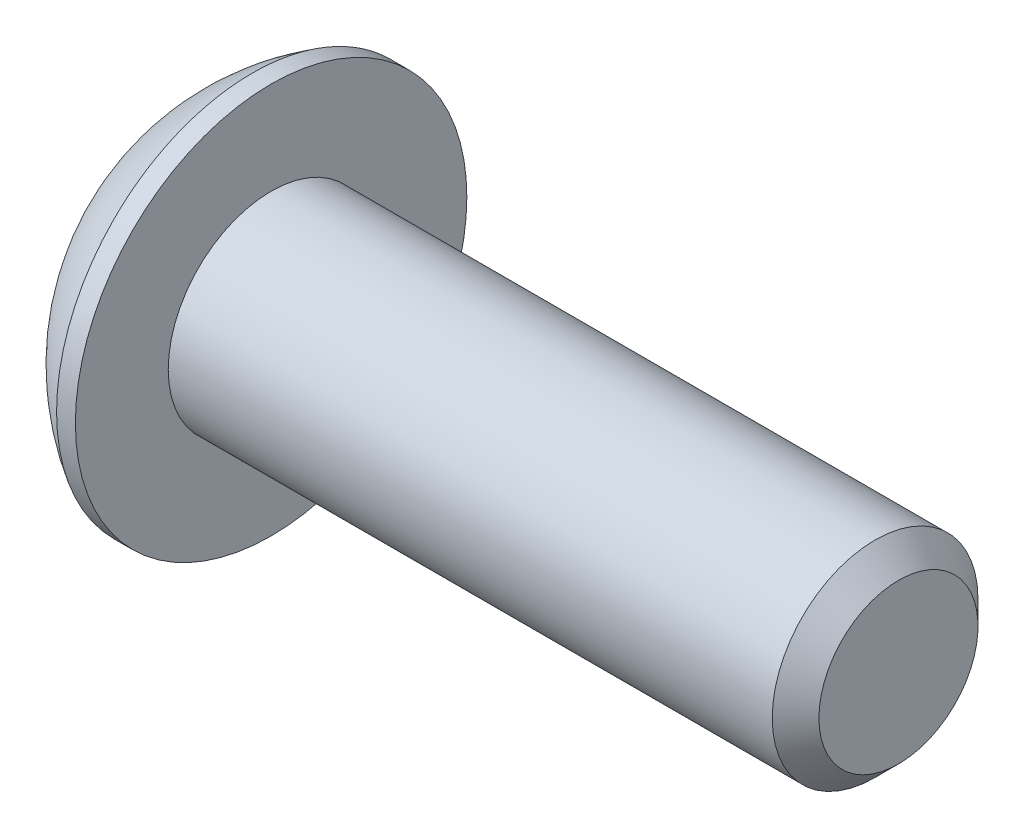
ISO-10303-21;
HEADER;
FILE_DESCRIPTION(('STEP AP214'),'2;1');
FILE_NAME('part.step','',(''),(''),'','','');
FILE_SCHEMA(('AUTOMOTIVE_DESIGN { 1 0 10303 214 1 1 1 1 }'));
ENDSEC;
DATA;
#1=APPLICATION_CONTEXT('core data for automotive mechanical design processes');
#2=APPLICATION_PROTOCOL_DEFINITION('international standard','automotive_design',2000,#1);
#3=PRODUCT_CONTEXT('',#1,'mechanical');
#4=PRODUCT('Part','Part','',(#3));
#5=PRODUCT_RELATED_PRODUCT_CATEGORY('part','',(#4));
#6=PRODUCT_DEFINITION_FORMATION('','',#4);
#7=PRODUCT_DEFINITION_CONTEXT('part definition',#1,'design');
#8=PRODUCT_DEFINITION('design','',#6,#7);
#9=PRODUCT_DEFINITION_SHAPE('','',#8);
#10=(LENGTH_UNIT() NAMED_UNIT(*) SI_UNIT(.MILLI.,.METRE.));
#11=(NAMED_UNIT(*) PLANE_ANGLE_UNIT() SI_UNIT($,.RADIAN.));
#12=(NAMED_UNIT(*) SI_UNIT($,.STERADIAN.) SOLID_ANGLE_UNIT());
#13=UNCERTAINTY_MEASURE_WITH_UNIT(LENGTH_MEASURE(1.E-05),#10,'distance_accuracy_value','');
#14=(GEOMETRIC_REPRESENTATION_CONTEXT(3) GLOBAL_UNCERTAINTY_ASSIGNED_CONTEXT((#13)) GLOBAL_UNIT_ASSIGNED_CONTEXT((#10,
#11,#12)) REPRESENTATION_CONTEXT('',''));
#15=CARTESIAN_POINT('',(0.,0.,0.));
#16=DIRECTION('',(0.,0.,1.));
#17=DIRECTION('',(1.,0.,0.));
#18=AXIS2_PLACEMENT_3D('',#15,#16,#17);
#19=CARTESIAN_POINT('',(1.32080000000034,0.,0.));
#20=DIRECTION('',(-1.,0.,0.));
#21=DIRECTION('',(0.,0.,1.));
#22=AXIS2_PLACEMENT_3D('',#19,#20,#21);
#23=CONICAL_SURFACE('',#22,1.1937999999998,1.04719755119608);
#24=CARTESIAN_POINT('',(2.01004075135902,0.,4.44089209850063E-13));
#25=VERTEX_POINT('',#24);
#26=VERTEX_LOOP('',#25);
#27=FACE_BOUND('',#26,.T.);
#28=CARTESIAN_POINT('',(1.32080000000009,0.,0.));
#29=DIRECTION('',(-1.,0.,0.));
#30=DIRECTION('',(0.,0.,1.));
#31=AXIS2_PLACEMENT_3D('',#28,#29,#30);
#32=CIRCLE('',#31,1.19380000000024);
#33=CARTESIAN_POINT('',(1.32080000000004,-1.03386112703797,0.59690000000006));
#34=VERTEX_POINT('',#33);
#35=CARTESIAN_POINT('',(1.32080000000004,0.,1.19380000000012));
#36=VERTEX_POINT('',#35);
#37=EDGE_CURVE('E19',#34,#36,#32,.T.);
#38=ORIENTED_EDGE('',*,*,#37,.T.);
#39=CARTESIAN_POINT('',(1.32080000000009,0.,0.));
#40=DIRECTION('',(-1.,0.,0.));
#41=DIRECTION('',(0.,0.,1.));
#42=AXIS2_PLACEMENT_3D('',#39,#40,#41);
#43=CIRCLE('',#42,1.19380000000024);
#44=CARTESIAN_POINT('',(1.32080000000004,1.03386112703797,0.596900000000061));
#45=VERTEX_POINT('',#44);
#46=EDGE_CURVE('E147',#36,#45,#43,.T.);
#47=ORIENTED_EDGE('',*,*,#46,.T.);
#48=CARTESIAN_POINT('',(1.32080000000009,0.,0.));
#49=DIRECTION('',(-1.,0.,0.));
#50=DIRECTION('',(0.,0.,1.));
#51=AXIS2_PLACEMENT_3D('',#48,#49,#50);
#52=CIRCLE('',#51,1.19380000000024);
#53=CARTESIAN_POINT('',(1.32080000000004,1.03386112703797,-0.596900000000061));
#54=VERTEX_POINT('',#53);
#55=EDGE_CURVE('E402',#45,#54,#52,.T.);
#56=ORIENTED_EDGE('',*,*,#55,.T.);
#57=CARTESIAN_POINT('',(1.32080000000009,0.,0.));
#58=DIRECTION('',(-1.,0.,0.));
#59=DIRECTION('',(0.,0.,1.));
#60=AXIS2_PLACEMENT_3D('',#57,#58,#59);
#61=CIRCLE('',#60,1.19380000000024);
#62=CARTESIAN_POINT('',(1.32080000000004,1.49457637585666E-12,-1.19380000000012));
#63=VERTEX_POINT('',#62);
#64=EDGE_CURVE('E403',#54,#63,#61,.T.);
#65=ORIENTED_EDGE('',*,*,#64,.T.);
#66=CARTESIAN_POINT('',(1.32080000000009,0.,0.));
#67=DIRECTION('',(-1.,0.,0.));
#68=DIRECTION('',(0.,0.,1.));
#69=AXIS2_PLACEMENT_3D('',#66,#67,#68);
#70=CIRCLE('',#69,1.19380000000024);
#71=CARTESIAN_POINT('',(1.32080000000004,-1.03386112703797,-0.59690000000006));
#72=VERTEX_POINT('',#71);
#73=EDGE_CURVE('E92',#63,#72,#70,.T.);
#74=ORIENTED_EDGE('',*,*,#73,.T.);
#75=CARTESIAN_POINT('',(1.32080000000009,0.,0.));
#76=DIRECTION('',(-1.,0.,0.));
#77=DIRECTION('',(0.,0.,1.));
#78=AXIS2_PLACEMENT_3D('',#75,#76,#77);
#79=CIRCLE('',#78,1.19380000000024);
#80=EDGE_CURVE('E88',#72,#34,#79,.T.);
#81=ORIENTED_EDGE('',*,*,#80,.T.);
#82=EDGE_LOOP('',(#38,#47,#56,#65,#74,#81));
#83=FACE_BOUND('',#82,.T.);
#84=ADVANCED_FACE('F16',(#27,#83),#23,.F.);
#85=CARTESIAN_POINT('',(1.3208,-2.06772225407572,-1.1938));
#86=DIRECTION('',(1.,0.,0.));
#87=DIRECTION('',(0.,0.,-1.));
#88=AXIS2_PLACEMENT_3D('',#85,#86,#87);
#89=PLANE('',#88);
#90=DIRECTION('',(0.,0.5,0.866025403784439));
#91=VECTOR('',#90,1.);
#92=CARTESIAN_POINT('',(1.3208,-1.37848150271715,0.));
#93=LINE('',#92,#91);
#94=CARTESIAN_POINT('',(1.3208,-0.689240751358574,1.1938));
#95=VERTEX_POINT('',#94);
#96=EDGE_CURVE('E100',#95,#34,#93,.F.);
#97=ORIENTED_EDGE('',*,*,#96,.F.);
#98=DIRECTION('',(0.,1.,0.));
#99=VECTOR('',#98,1.);
#100=CARTESIAN_POINT('',(1.3208,-0.689240751358574,1.1938));
#101=LINE('',#100,#99);
#102=EDGE_CURVE('E102',#36,#95,#101,.F.);
#103=ORIENTED_EDGE('',*,*,#102,.F.);
#104=ORIENTED_EDGE('',*,*,#37,.F.);
#105=EDGE_LOOP('',(#97,#103,#104));
#106=FACE_BOUND('',#105,.T.);
#107=ADVANCED_FACE('F98',(#106),#89,.F.);
#108=CARTESIAN_POINT('',(1.3208,-2.06772225407572,-1.1938));
#109=DIRECTION('',(1.,0.,0.));
#110=DIRECTION('',(0.,0.,-1.));
#111=AXIS2_PLACEMENT_3D('',#108,#109,#110);
#112=PLANE('',#111);
#113=DIRECTION('',(0.,-0.5,0.866025403784439));
#114=VECTOR('',#113,1.);
#115=CARTESIAN_POINT('',(1.3208,-0.689240751358574,-1.1938));
#116=LINE('',#115,#114);
#117=CARTESIAN_POINT('',(1.3208,-1.37848150271715,0.));
#118=VERTEX_POINT('',#117);
#119=EDGE_CURVE('E108',#118,#72,#116,.F.);
#120=ORIENTED_EDGE('',*,*,#119,.F.);
#121=DIRECTION('',(0.,0.5,0.866025403784439));
#122=VECTOR('',#121,1.);
#123=CARTESIAN_POINT('',(1.3208,-1.37848150271715,0.));
#124=LINE('',#123,#122);
#125=EDGE_CURVE('E105',#34,#118,#124,.F.);
#126=ORIENTED_EDGE('',*,*,#125,.F.);
#127=ORIENTED_EDGE('',*,*,#80,.F.);
#128=EDGE_LOOP('',(#120,#126,#127));
#129=FACE_BOUND('',#128,.T.);
#130=ADVANCED_FACE('F106',(#129),#112,.F.);
#131=CARTESIAN_POINT('',(1.3208,-2.06772225407572,-1.1938));
#132=DIRECTION('',(1.,0.,0.));
#133=DIRECTION('',(0.,0.,-1.));
#134=AXIS2_PLACEMENT_3D('',#131,#132,#133);
#135=PLANE('',#134);
#136=DIRECTION('',(0.,1.,0.));
#137=VECTOR('',#136,1.);
#138=CARTESIAN_POINT('',(1.3208,0.689240751358577,-1.1938));
#139=LINE('',#138,#137);
#140=CARTESIAN_POINT('',(1.3208,-0.689240751358574,-1.1938));
#141=VERTEX_POINT('',#140);
#142=EDGE_CURVE('E373',#141,#63,#139,.T.);
#143=ORIENTED_EDGE('',*,*,#142,.F.);
#144=DIRECTION('',(0.,-0.5,0.866025403784439));
#145=VECTOR('',#144,1.);
#146=CARTESIAN_POINT('',(1.3208,-0.689240751358574,-1.1938));
#147=LINE('',#146,#145);
#148=EDGE_CURVE('E385',#72,#141,#147,.F.);
#149=ORIENTED_EDGE('',*,*,#148,.F.);
#150=ORIENTED_EDGE('',*,*,#73,.F.);
#151=EDGE_LOOP('',(#143,#149,#150));
#152=FACE_BOUND('',#151,.T.);
#153=ADVANCED_FACE('F190',(#152),#135,.F.);
#154=CARTESIAN_POINT('',(1.3208,-2.06772225407572,-1.1938));
#155=DIRECTION('',(1.,0.,0.));
#156=DIRECTION('',(0.,0.,-1.));
#157=AXIS2_PLACEMENT_3D('',#154,#155,#156);
#158=PLANE('',#157);
#159=DIRECTION('',(0.,-0.5,-0.866025403784439));
#160=VECTOR('',#159,1.);
#161=CARTESIAN_POINT('',(1.3208,1.37848150271715,0.));
#162=LINE('',#161,#160);
#163=CARTESIAN_POINT('',(1.3208,0.689240751358577,-1.1938));
#164=VERTEX_POINT('',#163);
#165=EDGE_CURVE('E359',#164,#54,#162,.F.);
#166=ORIENTED_EDGE('',*,*,#165,.F.);
#167=DIRECTION('',(0.,1.,0.));
#168=VECTOR('',#167,1.);
#169=CARTESIAN_POINT('',(1.3208,0.689240751358577,-1.1938));
#170=LINE('',#169,#168);
#171=EDGE_CURVE('E370',#63,#164,#170,.T.);
#172=ORIENTED_EDGE('',*,*,#171,.F.);
#173=ORIENTED_EDGE('',*,*,#64,.F.);
#174=EDGE_LOOP('',(#166,#172,#173));
#175=FACE_BOUND('',#174,.T.);
#176=ADVANCED_FACE('F186',(#175),#158,.F.);
#177=CARTESIAN_POINT('',(1.3208,-2.06772225407572,-1.1938));
#178=DIRECTION('',(1.,0.,0.));
#179=DIRECTION('',(0.,0.,-1.));
#180=AXIS2_PLACEMENT_3D('',#177,#178,#179);
#181=PLANE('',#180);
#182=DIRECTION('',(0.,0.5,-0.866025403784439));
#183=VECTOR('',#182,1.);
#184=CARTESIAN_POINT('',(1.3208,0.689240751358576,1.1938));
#185=LINE('',#184,#183);
#186=CARTESIAN_POINT('',(1.3208,1.37848150271715,0.));
#187=VERTEX_POINT('',#186);
#188=EDGE_CURVE('E338',#187,#45,#185,.F.);
#189=ORIENTED_EDGE('',*,*,#188,.F.);
#190=DIRECTION('',(0.,-0.5,-0.866025403784439));
#191=VECTOR('',#190,1.);
#192=CARTESIAN_POINT('',(1.3208,1.37848150271715,0.));
#193=LINE('',#192,#191);
#194=EDGE_CURVE('E357',#54,#187,#193,.F.);
#195=ORIENTED_EDGE('',*,*,#194,.F.);
#196=ORIENTED_EDGE('',*,*,#55,.F.);
#197=EDGE_LOOP('',(#189,#195,#196));
#198=FACE_BOUND('',#197,.T.);
#199=ADVANCED_FACE('F182',(#198),#181,.F.);
#200=CARTESIAN_POINT('',(1.3208,-2.06772225407572,-1.1938));
#201=DIRECTION('',(1.,0.,0.));
#202=DIRECTION('',(0.,0.,-1.));
#203=AXIS2_PLACEMENT_3D('',#200,#201,#202);
#204=PLANE('',#203);
#205=DIRECTION('',(0.,1.,0.));
#206=VECTOR('',#205,1.);
#207=CARTESIAN_POINT('',(1.3208,-0.689240751358574,1.1938));
#208=LINE('',#207,#206);
#209=CARTESIAN_POINT('',(1.3208,0.689240751358576,1.1938));
#210=VERTEX_POINT('',#209);
#211=EDGE_CURVE('E117',#210,#36,#208,.F.);
#212=ORIENTED_EDGE('',*,*,#211,.F.);
#213=DIRECTION('',(0.,0.5,-0.866025403784439));
#214=VECTOR('',#213,1.);
#215=CARTESIAN_POINT('',(1.3208,0.689240751358576,1.1938));
#216=LINE('',#215,#214);
#217=EDGE_CURVE('E341',#45,#210,#216,.F.);
#218=ORIENTED_EDGE('',*,*,#217,.F.);
#219=ORIENTED_EDGE('',*,*,#46,.F.);
#220=EDGE_LOOP('',(#212,#218,#219));
#221=FACE_BOUND('',#220,.T.);
#222=ADVANCED_FACE('F178',(#221),#204,.F.);
#223=CARTESIAN_POINT('',(1.3208,-0.689240751358574,1.1938));
#224=DIRECTION('',(0.,0.,-1.));
#225=DIRECTION('',(0.,1.,0.));
#226=AXIS2_PLACEMENT_3D('',#223,#224,#225);
#227=PLANE('',#226);
#228=DIRECTION('',(0.,1.,0.));
#229=VECTOR('',#228,1.);
#230=CARTESIAN_POINT('',(0.,0.,1.1938));
#231=LINE('',#230,#229);
#232=CARTESIAN_POINT('',(0.,0.689240751358577,1.1938));
#233=VERTEX_POINT('',#232);
#234=CARTESIAN_POINT('',(0.,-0.689240751358574,1.1938));
#235=VERTEX_POINT('',#234);
#236=EDGE_CURVE('E335',#233,#235,#231,.F.);
#237=ORIENTED_EDGE('',*,*,#236,.F.);
#238=DIRECTION('',(1.,0.,0.));
#239=VECTOR('',#238,1.);
#240=CARTESIAN_POINT('',(1.3208,0.689240751358576,1.1938));
#241=LINE('',#240,#239);
#242=EDGE_CURVE('E347',#210,#233,#241,.F.);
#243=ORIENTED_EDGE('',*,*,#242,.F.);
#244=ORIENTED_EDGE('',*,*,#211,.T.);
#245=ORIENTED_EDGE('',*,*,#102,.T.);
#246=DIRECTION('',(1.,0.,0.));
#247=VECTOR('',#246,1.);
#248=CARTESIAN_POINT('',(1.3208,-0.689240751358574,1.1938));
#249=LINE('',#248,#247);
#250=EDGE_CURVE('E111',#235,#95,#249,.T.);
#251=ORIENTED_EDGE('',*,*,#250,.F.);
#252=EDGE_LOOP('',(#237,#243,#244,#245,#251));
#253=FACE_BOUND('',#252,.T.);
#254=ADVANCED_FACE('F175',(#253),#227,.T.);
#255=CARTESIAN_POINT('',(1.3208,-1.37848150271715,0.));
#256=DIRECTION('',(0.,0.866025403784439,-0.5));
#257=DIRECTION('',(0.,0.5,0.866025403784439));
#258=AXIS2_PLACEMENT_3D('',#255,#256,#257);
#259=PLANE('',#258);
#260=DIRECTION('',(0.,-0.5,-0.866025403784439));
#261=VECTOR('',#260,1.);
#262=CARTESIAN_POINT('',(0.,-0.689240751358574,1.1938));
#263=LINE('',#262,#261);
#264=CARTESIAN_POINT('',(0.,-1.37848150271715,0.));
#265=VERTEX_POINT('',#264);
#266=EDGE_CURVE('E332',#235,#265,#263,.T.);
#267=ORIENTED_EDGE('',*,*,#266,.F.);
#268=ORIENTED_EDGE('',*,*,#250,.T.);
#269=ORIENTED_EDGE('',*,*,#96,.T.);
#270=ORIENTED_EDGE('',*,*,#125,.T.);
#271=DIRECTION('',(1.,0.,0.));
#272=VECTOR('',#271,1.);
#273=CARTESIAN_POINT('',(1.3208,-1.37848150271715,0.));
#274=LINE('',#273,#272);
#275=EDGE_CURVE('E382',#265,#118,#274,.T.);
#276=ORIENTED_EDGE('',*,*,#275,.F.);
#277=EDGE_LOOP('',(#267,#268,#269,#270,#276));
#278=FACE_BOUND('',#277,.T.);
#279=ADVANCED_FACE('F115',(#278),#259,.T.);
#280=CARTESIAN_POINT('',(1.3208,-0.689240751358574,-1.1938));
#281=DIRECTION('',(0.,0.866025403784439,0.5));
#282=DIRECTION('',(0.,-0.5,0.866025403784439));
#283=AXIS2_PLACEMENT_3D('',#280,#281,#282);
#284=PLANE('',#283);
#285=DIRECTION('',(0.,0.5,-0.866025403784439));
#286=VECTOR('',#285,1.);
#287=CARTESIAN_POINT('',(0.,-1.37848150271715,0.));
#288=LINE('',#287,#286);
#289=CARTESIAN_POINT('',(0.,-0.689240751358574,-1.1938));
#290=VERTEX_POINT('',#289);
#291=EDGE_CURVE('E329',#265,#290,#288,.T.);
#292=ORIENTED_EDGE('',*,*,#291,.F.);
#293=ORIENTED_EDGE('',*,*,#275,.T.);
#294=ORIENTED_EDGE('',*,*,#119,.T.);
#295=ORIENTED_EDGE('',*,*,#148,.T.);
#296=DIRECTION('',(1.,0.,0.));
#297=VECTOR('',#296,1.);
#298=CARTESIAN_POINT('',(1.3208,-0.689240751358574,-1.1938));
#299=LINE('',#298,#297);
#300=EDGE_CURVE('E367',#290,#141,#299,.T.);
#301=ORIENTED_EDGE('',*,*,#300,.F.);
#302=EDGE_LOOP('',(#292,#293,#294,#295,#301));
#303=FACE_BOUND('',#302,.T.);
#304=ADVANCED_FACE('F168',(#303),#284,.T.);
#305=CARTESIAN_POINT('',(1.3208,0.689240751358577,-1.1938));
#306=DIRECTION('',(0.,0.,1.));
#307=DIRECTION('',(1.,0.,0.));
#308=AXIS2_PLACEMENT_3D('',#305,#306,#307);
#309=PLANE('',#308);
#310=DIRECTION('',(0.,1.,0.));
#311=VECTOR('',#310,1.);
#312=CARTESIAN_POINT('',(0.,0.,-1.1938));
#313=LINE('',#312,#311);
#314=CARTESIAN_POINT('',(0.,0.689240751358577,-1.1938));
#315=VERTEX_POINT('',#314);
#316=EDGE_CURVE('E326',#290,#315,#313,.T.);
#317=ORIENTED_EDGE('',*,*,#316,.F.);
#318=ORIENTED_EDGE('',*,*,#300,.T.);
#319=ORIENTED_EDGE('',*,*,#142,.T.);
#320=ORIENTED_EDGE('',*,*,#171,.T.);
#321=DIRECTION('',(1.,0.,0.));
#322=VECTOR('',#321,1.);
#323=CARTESIAN_POINT('',(1.3208,0.689240751358577,-1.1938));
#324=LINE('',#323,#322);
#325=EDGE_CURVE('E342',#315,#164,#324,.T.);
#326=ORIENTED_EDGE('',*,*,#325,.F.);
#327=EDGE_LOOP('',(#317,#318,#319,#320,#326));
#328=FACE_BOUND('',#327,.T.);
#329=ADVANCED_FACE('F165',(#328),#309,.T.);
#330=CARTESIAN_POINT('',(1.3208,1.37848150271715,0.));
#331=DIRECTION('',(0.,-0.866025403784439,0.5));
#332=DIRECTION('',(0.,-0.5,-0.866025403784439));
#333=AXIS2_PLACEMENT_3D('',#330,#331,#332);
#334=PLANE('',#333);
#335=DIRECTION('',(0.,0.5,0.866025403784439));
#336=VECTOR('',#335,1.);
#337=CARTESIAN_POINT('',(0.,0.689240751358577,-1.1938));
#338=LINE('',#337,#336);
#339=CARTESIAN_POINT('',(0.,1.37848150271715,0.));
#340=VERTEX_POINT('',#339);
#341=EDGE_CURVE('E323',#315,#340,#338,.T.);
#342=ORIENTED_EDGE('',*,*,#341,.F.);
#343=ORIENTED_EDGE('',*,*,#325,.T.);
#344=ORIENTED_EDGE('',*,*,#165,.T.);
#345=ORIENTED_EDGE('',*,*,#194,.T.);
#346=DIRECTION('',(1.,0.,0.));
#347=VECTOR('',#346,1.);
#348=CARTESIAN_POINT('',(1.3208,1.37848150271715,0.));
#349=LINE('',#348,#347);
#350=EDGE_CURVE('E34',#340,#187,#349,.T.);
#351=ORIENTED_EDGE('',*,*,#350,.F.);
#352=EDGE_LOOP('',(#342,#343,#344,#345,#351));
#353=FACE_BOUND('',#352,.T.);
#354=ADVANCED_FACE('F161',(#353),#334,.T.);
#355=CARTESIAN_POINT('',(1.3208,0.689240751358576,1.1938));
#356=DIRECTION('',(0.,-0.866025403784439,-0.5));
#357=DIRECTION('',(0.,0.5,-0.866025403784439));
#358=AXIS2_PLACEMENT_3D('',#355,#356,#357);
#359=PLANE('',#358);
#360=DIRECTION('',(0.,-0.5,0.866025403784439));
#361=VECTOR('',#360,1.);
#362=CARTESIAN_POINT('',(0.,1.37848150271715,0.));
#363=LINE('',#362,#361);
#364=EDGE_CURVE('E146',#340,#233,#363,.T.);
#365=ORIENTED_EDGE('',*,*,#364,.F.);
#366=ORIENTED_EDGE('',*,*,#350,.T.);
#367=ORIENTED_EDGE('',*,*,#188,.T.);
#368=ORIENTED_EDGE('',*,*,#217,.T.);
#369=ORIENTED_EDGE('',*,*,#242,.T.);
#370=EDGE_LOOP('',(#365,#366,#367,#368,#369));
#371=FACE_BOUND('',#370,.T.);
#372=ADVANCED_FACE('F157',(#371),#359,.T.);
#373=CARTESIAN_POINT('',(0.,0.,0.));
#374=DIRECTION('',(-1.,0.,0.));
#375=DIRECTION('',(0.,0.,1.));
#376=AXIS2_PLACEMENT_3D('',#373,#374,#375);
#377=PLANE('',#376);
#378=ORIENTED_EDGE('',*,*,#341,.T.);
#379=ORIENTED_EDGE('',*,*,#364,.T.);
#380=ORIENTED_EDGE('',*,*,#236,.T.);
#381=ORIENTED_EDGE('',*,*,#266,.T.);
#382=ORIENTED_EDGE('',*,*,#291,.T.);
#383=ORIENTED_EDGE('',*,*,#316,.T.);
#384=EDGE_LOOP('',(#378,#379,#380,#381,#382,#383));
#385=FACE_BOUND('',#384,.T.);
#386=CARTESIAN_POINT('',(0.,1.9812,0.));
#387=CARTESIAN_POINT('',(0.,1.9811996664299,0.0556258831179428));
#388=CARTESIAN_POINT('',(0.,1.97885520380442,0.111261989398606));
#389=CARTESIAN_POINT('',(0.,1.96949260169541,0.222149719830458));
#390=CARTESIAN_POINT('',(0.,1.96247308239605,0.277401225602895));
#391=CARTESIAN_POINT('',(0.,1.94379192841038,0.387209508139747));
#392=CARTESIAN_POINT('',(-1.85325793235264E-13,1.93212292489526,0.441765039546365));
#393=CARTESIAN_POINT('',(1.86344214223505E-13,1.90422331175315,0.549729449347493));
#394=CARTESIAN_POINT('',(6.94543371897454E-13,1.88798900035338,0.603137359208869));
#395=CARTESIAN_POINT('',(1.15501975216981E-12,1.83266214476501,0.760839131321828));
#396=CARTESIAN_POINT('',(0.,1.78690023648845,0.862876433575429));
#397=CARTESIAN_POINT('',(0.,1.67887358150667,1.05780719540872));
#398=CARTESIAN_POINT('',(9.54193214892627E-13,1.6166082074585,1.15070030720801));
#399=CARTESIAN_POINT('',(5.94805591894675E-13,1.51224157140982,1.28116890915697));
#400=CARTESIAN_POINT('',(1.63221293851378E-13,1.4755970394354,1.32320451127026));
#401=CARTESIAN_POINT('',(-1.62196980336157E-13,1.39893832619713,1.40400288695709));
#402=CARTESIAN_POINT('',(0.,1.35892742784698,1.44276877695455));
#403=CARTESIAN_POINT('',(1.14362537325405E-13,1.23416504602197,1.55382272417904));
#404=CARTESIAN_POINT('',(0.,1.14466125559859,1.62089527952111));
#405=CARTESIAN_POINT('',(0.,0.955712144178167,1.7390221808118));
#406=CARTESIAN_POINT('',(0.,0.856267198233564,1.79007713076007));
#407=CARTESIAN_POINT('',(0.,0.650206345910843,1.87477637530954));
#408=CARTESIAN_POINT('',(0.,0.543590516134855,1.90842085586267));
#409=CARTESIAN_POINT('',(0.,0.326226155292018,1.95733039300656));
#410=CARTESIAN_POINT('',(0.,0.21547760215793,1.97259535144288));
#411=CARTESIAN_POINT('',(0.,-0.00701040587544639,1.98431697865418));
#412=CARTESIAN_POINT('',(0.,-0.118749860774734,1.98077364742917));
#413=CARTESIAN_POINT('',(0.,-0.340050178355485,1.95497485623825));
#414=CARTESIAN_POINT('',(0.,-0.449611052668255,1.93271949620218));
#415=CARTESIAN_POINT('',(0.,-0.663431110729174,1.87014138774523));
#416=CARTESIAN_POINT('',(0.,-0.76769023783852,1.82981844635272));
#417=CARTESIAN_POINT('',(0.,-0.968005760719347,1.73219968377096));
#418=CARTESIAN_POINT('',(0.,-1.0640618469811,1.6749032225164));
#419=CARTESIAN_POINT('',(0.,-1.19980276751283,1.57757371205873));
#420=CARTESIAN_POINT('',(0.,-1.24366557129213,1.54322665019466));
#421=CARTESIAN_POINT('',(0.,-1.32838995706696,1.47093063174264));
#422=CARTESIAN_POINT('',(0.,-1.36924860178706,1.43297823102439));
#423=CARTESIAN_POINT('',(0.,-1.48674671849223,1.31419842051173));
#424=CARTESIAN_POINT('',(0.,-1.55842832343237,1.22836221289311));
#425=CARTESIAN_POINT('',(0.,-1.6863396856475,1.04586168272493));
#426=CARTESIAN_POINT('',(0.,-1.7425700302488,0.949197771949774));
#427=CARTESIAN_POINT('',(0.,-1.8141614250401,0.798182600298684));
#428=CARTESIAN_POINT('',(0.,-1.83591780585875,0.746776203847791));
#429=CARTESIAN_POINT('',(0.,-1.87500754181092,0.642341081688636));
#430=CARTESIAN_POINT('',(0.,-1.89234447645404,0.589313708122847));
#431=CARTESIAN_POINT('',(0.,-1.92246053433554,0.482076273028395));
#432=CARTESIAN_POINT('',(0.,-1.93524685475118,0.42786822425751));
#433=CARTESIAN_POINT('',(0.,-1.95620937250494,0.318578151844611));
#434=CARTESIAN_POINT('',(0.,-1.96438692958147,0.263496390912872));
#435=CARTESIAN_POINT('',(0.,-1.97388528284653,0.173607715038558));
#436=CARTESIAN_POINT('',(0.,-1.97662743364426,0.138944718024998));
#437=CARTESIAN_POINT('',(0.,-1.98028489645283,0.0695224782567002));
#438=CARTESIAN_POINT('',(0.,-1.98120020846367,0.0347632355019631));
#439=CARTESIAN_POINT('',(0.,-1.9811996664299,-0.0556258831179437));
#440=CARTESIAN_POINT('',(0.,-1.97885520380442,-0.111261989398607));
#441=CARTESIAN_POINT('',(0.,-1.96949260169541,-0.222149719830459));
#442=CARTESIAN_POINT('',(0.,-1.96247308239605,-0.277401225602897));
#443=CARTESIAN_POINT('',(0.,-1.94379192841039,-0.387209508139749));
#444=CARTESIAN_POINT('',(-1.85269749640691E-13,-1.93212292489526,-0.441765039546367));
#445=CARTESIAN_POINT('',(1.86288125054388E-13,-1.90422331175315,-0.549729449347495));
#446=CARTESIAN_POINT('',(6.94525090263764E-13,-1.88798900035338,-0.603137359208872));
#447=CARTESIAN_POINT('',(1.15505622829081E-12,-1.83266214476501,-0.760839131321831));
#448=CARTESIAN_POINT('',(0.,-1.78690023648845,-0.862876433575431));
#449=CARTESIAN_POINT('',(0.,-1.67887358150667,-1.05780719540872));
#450=CARTESIAN_POINT('',(9.54248812869379E-13,-1.6166082074585,-1.15070030720801));
#451=CARTESIAN_POINT('',(5.94777756479239E-13,-1.51224157140982,-1.28116890915698));
#452=CARTESIAN_POINT('',(1.63138949183833E-13,-1.47559703943539,-1.32320451127027));
#453=CARTESIAN_POINT('',(-1.62114715061273E-13,-1.39893832619713,-1.40400288695709));
#454=CARTESIAN_POINT('',(0.,-1.35892742784699,-1.44276877695455));
#455=CARTESIAN_POINT('',(1.13760489124207E-13,-1.23416504602197,-1.55382272417904));
#456=CARTESIAN_POINT('',(0.,-1.14466125559859,-1.62089527952111));
#457=CARTESIAN_POINT('',(0.,-0.95571214417816,-1.73902218081179));
#458=CARTESIAN_POINT('',(0.,-0.856267198233559,-1.79007713076007));
#459=CARTESIAN_POINT('',(0.,-0.650206345910841,-1.87477637530954));
#460=CARTESIAN_POINT('',(0.,-0.543590516134854,-1.90842085586267));
#461=CARTESIAN_POINT('',(0.,-0.326226155292018,-1.95733039300657));
#462=CARTESIAN_POINT('',(0.,-0.215477602157929,-1.97259535144288));
#463=CARTESIAN_POINT('',(0.,0.0070104058754487,-1.98431697865418));
#464=CARTESIAN_POINT('',(0.,0.118749860774737,-1.98077364742916));
#465=CARTESIAN_POINT('',(0.,0.340050178355489,-1.95497485623824));
#466=CARTESIAN_POINT('',(0.,0.44961105266826,-1.93271949620218));
#467=CARTESIAN_POINT('',(0.,0.663431110729178,-1.87014138774524));
#468=CARTESIAN_POINT('',(0.,0.767690237838524,-1.82981844635272));
#469=CARTESIAN_POINT('',(0.,0.968005760719348,-1.73219968377096));
#470=CARTESIAN_POINT('',(0.,1.0640618469811,-1.67490322251639));
#471=CARTESIAN_POINT('',(0.,1.19980276751283,-1.57757371205873));
#472=CARTESIAN_POINT('',(0.,1.24366557129214,-1.54322665019465));
#473=CARTESIAN_POINT('',(0.,1.32838995706696,-1.47093063174263));
#474=CARTESIAN_POINT('',(0.,1.36924860178706,-1.43297823102439));
#475=CARTESIAN_POINT('',(0.,1.48674671849223,-1.31419842051172));
#476=CARTESIAN_POINT('',(0.,1.55842832343237,-1.22836221289311));
#477=CARTESIAN_POINT('',(0.,1.6863396856475,-1.04586168272492));
#478=CARTESIAN_POINT('',(0.,1.7425700302488,-0.949197771949768));
#479=CARTESIAN_POINT('',(0.,1.8141614250401,-0.798182600298677));
#480=CARTESIAN_POINT('',(0.,1.83591780585875,-0.746776203847785));
#481=CARTESIAN_POINT('',(0.,1.87500754181092,-0.64234108168863));
#482=CARTESIAN_POINT('',(0.,1.89234447645404,-0.589313708122841));
#483=CARTESIAN_POINT('',(0.,1.92246053433555,-0.482076273028389));
#484=CARTESIAN_POINT('',(0.,1.93524685475118,-0.427868224257505));
#485=CARTESIAN_POINT('',(0.,1.95620937250494,-0.318578151844605));
#486=CARTESIAN_POINT('',(0.,1.96438692958147,-0.263496390912866));
#487=CARTESIAN_POINT('',(0.,1.97388528284653,-0.173607715038553));
#488=CARTESIAN_POINT('',(0.,1.97662743364426,-0.138944718024994));
#489=CARTESIAN_POINT('',(0.,1.98028489645283,-0.0695224782566989));
#490=CARTESIAN_POINT('',(0.,1.98120020846367,-0.034763235501963));
#491=CARTESIAN_POINT('',(0.,1.9812,0.));
#492=B_SPLINE_CURVE_WITH_KNOTS('',3,(#386,#387,#388,#389,#390,#391,#392,#393,#394,#395,#396,
#397,#398,#399,#400,#401,#402,#403,#404,#405,#406,#407,#408,#409,#410,#411,#412,#413,#414,#415,
#416,#417,#418,#419,#420,#421,#422,#423,#424,#425,#426,#427,#428,#429,#430,#431,#432,#433,#434,
#435,#436,#437,#438,#439,#440,#441,#442,#443,#444,#445,#446,#447,#448,#449,#450,#451,#452,#453,
#454,#455,#456,#457,#458,#459,#460,#461,#462,#463,#464,#465,#466,#467,#468,#469,#470,#471,#472,
#473,#474,#475,#476,#477,#478,#479,#480,#481,#482,#483,#484,#485,#486,#487,#488,#489,#490,#491),
.UNSPECIFIED.,.T.,.F.,(4,2,2,2,2,2,2,2,2,2,2,2,2,2,2,2,2,2,2,2,2,2,2,2,2,2,2,2,2,2,2,2,2,2,2,2,
2,2,2,2,2,2,2,2,2,2,2,2,2,2,2,2,4),(0.,0.166845646007828,0.333740557374255,0.500901034367693,
0.668197445942386,1.00199278686282,1.33580081809885,1.50292354032982,1.6698851310853,
2.00370118900129,2.33750465770544,2.67130456115909,3.005106247238,3.33890793331696,
3.67270783677065,4.00651130547476,4.34032736339026,4.50728895414554,4.67441167637632,
5.00821970761259,5.34201504853332,5.50931146010827,5.67647193710191,5.84336684846844,
6.0102124944764,6.11448220058334,6.21875190669029,6.38559755269812,6.55249246406454,
6.71965294105798,6.88694935263268,7.22074469355311,7.55455272478915,7.72167544702011,
7.88863703777559,8.22245309569158,8.55625656439573,8.89005646784938,9.2238581539283,
9.55765984000725,9.89145974346094,10.2252632121651,10.5590792700806,10.7260408608358,
10.8931635830666,11.2269716143029,11.5607669552236,11.7280633667986,11.8952238437922,
12.0621187551587,12.2289644011667,12.3332341072736,12.4375038133806),.UNSPECIFIED.);
#493=CARTESIAN_POINT('',(0.,1.9812,0.));
#494=VERTEX_POINT('',#493);
#495=EDGE_CURVE('E139',#494,#494,#492,.T.);
#496=ORIENTED_EDGE('',*,*,#495,.F.);
#497=EDGE_LOOP('',(#496));
#498=FACE_BOUND('',#497,.T.);
#499=ADVANCED_FACE('F153',(#385,#498),#377,.T.);
#500=CARTESIAN_POINT('',(4.13385,0.,0.));
#501=DIRECTION('',(0.,1.,0.));
#502=DIRECTION('',(1.,0.,0.));
#503=AXIS2_PLACEMENT_3D('',#500,#501,#502);
#504=SPHERICAL_SURFACE('',#503,4.58408870578439);
#505=CARTESIAN_POINT('',(1.8288,0.,0.));
#506=DIRECTION('',(-1.,0.,0.));
#507=DIRECTION('',(0.,0.,1.));
#508=AXIS2_PLACEMENT_3D('',#505,#506,#507);
#509=CIRCLE('',#508,3.9624);
#510=CARTESIAN_POINT('',(1.8288,0.,3.9624));
#511=VERTEX_POINT('',#510);
#512=EDGE_CURVE('E136',#511,#511,#509,.F.);
#513=ORIENTED_EDGE('',*,*,#512,.F.);
#514=EDGE_LOOP('',(#513));
#515=FACE_BOUND('',#514,.T.);
#516=ORIENTED_EDGE('',*,*,#495,.T.);
#517=EDGE_LOOP('',(#516));
#518=FACE_BOUND('',#517,.T.);
#519=ADVANCED_FACE('F149',(#515,#518),#504,.T.);
#520=CARTESIAN_POINT('',(14.9098,0.,0.));
#521=DIRECTION('',(-1.,0.,0.));
#522=DIRECTION('',(0.,0.,1.));
#523=AXIS2_PLACEMENT_3D('',#520,#521,#522);
#524=PLANE('',#523);
#525=CARTESIAN_POINT('',(14.9098000000549,0.,0.));
#526=DIRECTION('',(-1.,0.,0.));
#527=DIRECTION('',(0.,0.,1.));
#528=AXIS2_PLACEMENT_3D('',#525,#526,#527);
#529=CIRCLE('',#528,1.61035999997239);
#530=CARTESIAN_POINT('',(14.9098000000549,0.,1.61035999997239));
#531=VERTEX_POINT('',#530);
#532=EDGE_CURVE('E133',#531,#531,#529,.T.);
#533=ORIENTED_EDGE('',*,*,#532,.F.);
#534=EDGE_LOOP('',(#533));
#535=FACE_BOUND('',#534,.T.);
#536=ADVANCED_FACE('F220',(#535),#524,.F.);
#537=CARTESIAN_POINT('',(0.,0.,0.));
#538=DIRECTION('',(-1.,0.,0.));
#539=DIRECTION('',(0.,0.,1.));
#540=AXIS2_PLACEMENT_3D('',#537,#538,#539);
#541=CYLINDRICAL_SURFACE('',#540,3.9624);
#542=ORIENTED_EDGE('',*,*,#512,.T.);
#543=EDGE_LOOP('',(#542));
#544=FACE_BOUND('',#543,.T.);
#545=CARTESIAN_POINT('',(2.2098,0.,0.));
#546=DIRECTION('',(-1.,0.,0.));
#547=DIRECTION('',(0.,0.,1.));
#548=AXIS2_PLACEMENT_3D('',#545,#546,#547);
#549=CIRCLE('',#548,3.9624);
#550=CARTESIAN_POINT('',(2.2098,0.,3.9624));
#551=VERTEX_POINT('',#550);
#552=EDGE_CURVE('E130',#551,#551,#549,.T.);
#553=ORIENTED_EDGE('',*,*,#552,.T.);
#554=EDGE_LOOP('',(#553));
#555=FACE_BOUND('',#554,.T.);
#556=ADVANCED_FACE('F217',(#544,#555),#541,.T.);
#557=CARTESIAN_POINT('',(14.4373599999881,0.,0.));
#558=DIRECTION('',(-1.,0.,0.));
#559=DIRECTION('',(0.,0.,1.));
#560=AXIS2_PLACEMENT_3D('',#557,#558,#559);
#561=CONICAL_SURFACE('',#560,2.08280000003924,0.785398163397448);
#562=CARTESIAN_POINT('',(14.43736,0.,0.));
#563=DIRECTION('',(-1.,0.,0.));
#564=DIRECTION('',(0.,0.,1.));
#565=AXIS2_PLACEMENT_3D('',#562,#563,#564);
#566=CIRCLE('',#565,2.0828);
#567=CARTESIAN_POINT('',(14.43736,0.,2.0828));
#568=VERTEX_POINT('',#567);
#569=EDGE_CURVE('E25',#568,#568,#566,.T.);
#570=ORIENTED_EDGE('',*,*,#569,.F.);
#571=EDGE_LOOP('',(#570));
#572=FACE_BOUND('',#571,.T.);
#573=ORIENTED_EDGE('',*,*,#532,.T.);
#574=EDGE_LOOP('',(#573));
#575=FACE_BOUND('',#574,.T.);
#576=ADVANCED_FACE('F210',(#572,#575),#561,.T.);
#577=CARTESIAN_POINT('',(2.2098,2.0828,0.));
#578=DIRECTION('',(-1.,0.,0.));
#579=DIRECTION('',(0.,0.,1.));
#580=AXIS2_PLACEMENT_3D('',#577,#578,#579);
#581=PLANE('',#580);
#582=CARTESIAN_POINT('',(2.2098,0.,0.));
#583=DIRECTION('',(-1.,0.,0.));
#584=DIRECTION('',(0.,0.,1.));
#585=AXIS2_PLACEMENT_3D('',#582,#583,#584);
#586=CIRCLE('',#585,2.0828);
#587=CARTESIAN_POINT('',(2.2098,0.,2.0828));
#588=VERTEX_POINT('',#587);
#589=EDGE_CURVE('E10',#588,#588,#586,.F.);
#590=ORIENTED_EDGE('',*,*,#589,.F.);
#591=EDGE_LOOP('',(#590));
#592=FACE_BOUND('',#591,.T.);
#593=ORIENTED_EDGE('',*,*,#552,.F.);
#594=EDGE_LOOP('',(#593));
#595=FACE_BOUND('',#594,.T.);
#596=ADVANCED_FACE('F204',(#592,#595),#581,.F.);
#597=CARTESIAN_POINT('',(0.,0.,0.));
#598=DIRECTION('',(-1.,0.,0.));
#599=DIRECTION('',(0.,0.,1.));
#600=AXIS2_PLACEMENT_3D('',#597,#598,#599);
#601=CYLINDRICAL_SURFACE('',#600,2.0828);
#602=ORIENTED_EDGE('',*,*,#589,.T.);
#603=EDGE_LOOP('',(#602));
#604=FACE_BOUND('',#603,.T.);
#605=ORIENTED_EDGE('',*,*,#569,.T.);
#606=EDGE_LOOP('',(#605));
#607=FACE_BOUND('',#606,.T.);
#608=ADVANCED_FACE('F202',(#604,#607),#601,.T.);
#609=CLOSED_SHELL('',(#84,#107,#130,#153,#176,#199,#222,#254,#279,#304,#329,#354,#372,#499,#519,
#536,#556,#576,#596,#608));
#610=MANIFOLD_SOLID_BREP('B1',#609);
#611=ADVANCED_BREP_SHAPE_REPRESENTATION('',(#18,#610),#14);
#612=SHAPE_DEFINITION_REPRESENTATION(#9,#611);
ENDSEC;
END-ISO-10303-21;
